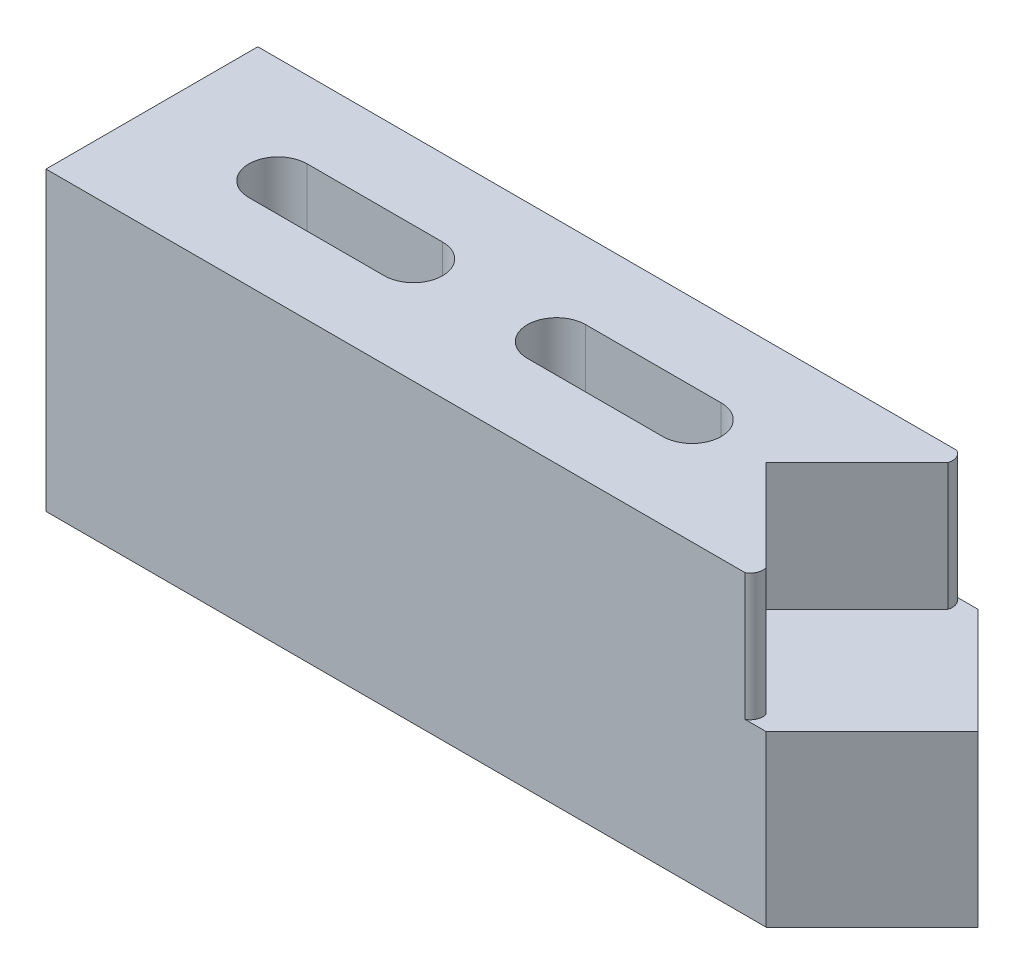
ISO-10303-21;
HEADER;
FILE_DESCRIPTION(('STEP AP214'),'2;1');
FILE_NAME('part.step','',(''),(''),'','','');
FILE_SCHEMA(('AUTOMOTIVE_DESIGN { 1 0 10303 214 1 1 1 1 }'));
ENDSEC;
DATA;
#1=APPLICATION_CONTEXT('core data for automotive mechanical design processes');
#2=APPLICATION_PROTOCOL_DEFINITION('international standard','automotive_design',2000,#1);
#3=PRODUCT_CONTEXT('',#1,'mechanical');
#4=PRODUCT('Part','Part','',(#3));
#5=PRODUCT_RELATED_PRODUCT_CATEGORY('part','',(#4));
#6=PRODUCT_DEFINITION_FORMATION('','',#4);
#7=PRODUCT_DEFINITION_CONTEXT('part definition',#1,'design');
#8=PRODUCT_DEFINITION('design','',#6,#7);
#9=PRODUCT_DEFINITION_SHAPE('','',#8);
#10=(LENGTH_UNIT() NAMED_UNIT(*) SI_UNIT(.MILLI.,.METRE.));
#11=(NAMED_UNIT(*) PLANE_ANGLE_UNIT() SI_UNIT($,.RADIAN.));
#12=(NAMED_UNIT(*) SI_UNIT($,.STERADIAN.) SOLID_ANGLE_UNIT());
#13=UNCERTAINTY_MEASURE_WITH_UNIT(LENGTH_MEASURE(1.E-05),#10,'distance_accuracy_value','');
#14=(GEOMETRIC_REPRESENTATION_CONTEXT(3) GLOBAL_UNCERTAINTY_ASSIGNED_CONTEXT((#13)) GLOBAL_UNIT_ASSIGNED_CONTEXT((#10,
#11,#12)) REPRESENTATION_CONTEXT('',''));
#15=CARTESIAN_POINT('',(0.,0.,0.));
#16=DIRECTION('',(0.,0.,1.));
#17=DIRECTION('',(1.,0.,0.));
#18=AXIS2_PLACEMENT_3D('',#15,#16,#17);
#19=CARTESIAN_POINT('',(0.,0.,-12.7));
#20=DIRECTION('',(-1.,0.,0.));
#21=DIRECTION('',(0.,0.,1.));
#22=AXIS2_PLACEMENT_3D('',#19,#20,#21);
#23=PLANE('',#22);
#24=DIRECTION('',(0.,-1.,0.));
#25=VECTOR('',#24,1.);
#26=CARTESIAN_POINT('',(0.,0.,0.));
#27=LINE('',#26,#25);
#28=CARTESIAN_POINT('',(0.,17.78,0.));
#29=VERTEX_POINT('',#28);
#30=CARTESIAN_POINT('',(0.,0.,0.));
#31=VERTEX_POINT('',#30);
#32=EDGE_CURVE('E191',#29,#31,#27,.T.);
#33=ORIENTED_EDGE('',*,*,#32,.F.);
#34=DIRECTION('',(0.,0.,1.));
#35=VECTOR('',#34,1.);
#36=CARTESIAN_POINT('',(0.,17.78,-12.7));
#37=LINE('',#36,#35);
#38=CARTESIAN_POINT('',(0.,17.78,-12.7));
#39=VERTEX_POINT('',#38);
#40=EDGE_CURVE('E11',#39,#29,#37,.T.);
#41=ORIENTED_EDGE('',*,*,#40,.F.);
#42=DIRECTION('',(0.,-1.,0.));
#43=VECTOR('',#42,1.);
#44=CARTESIAN_POINT('',(0.,0.,-12.7));
#45=LINE('',#44,#43);
#46=CARTESIAN_POINT('',(0.,0.,-12.7));
#47=VERTEX_POINT('',#46);
#48=EDGE_CURVE('E192',#39,#47,#45,.T.);
#49=ORIENTED_EDGE('',*,*,#48,.T.);
#50=DIRECTION('',(0.,0.,1.));
#51=VECTOR('',#50,1.);
#52=CARTESIAN_POINT('',(0.,0.,-12.7));
#53=LINE('',#52,#51);
#54=EDGE_CURVE('E38',#47,#31,#53,.T.);
#55=ORIENTED_EDGE('',*,*,#54,.T.);
#56=EDGE_LOOP('',(#33,#41,#49,#55));
#57=FACE_BOUND('',#56,.T.);
#58=ADVANCED_FACE('F35',(#57),#23,.T.);
#59=CARTESIAN_POINT('',(0.,17.78,-12.7));
#60=DIRECTION('',(0.,1.,0.));
#61=DIRECTION('',(0.,0.,1.));
#62=AXIS2_PLACEMENT_3D('',#59,#60,#61);
#63=PLANE('',#62);
#64=CARTESIAN_POINT('',(41.5537712268932,17.78,-12.0263939866578));
#65=DIRECTION('',(0.,-1.,0.));
#66=DIRECTION('',(0.,0.,-1.));
#67=AXIS2_PLACEMENT_3D('',#64,#65,#66);
#68=CIRCLE('',#67,0.762);
#69=CARTESIAN_POINT('',(41.91,17.78,-12.7));
#70=VERTEX_POINT('',#69);
#71=CARTESIAN_POINT('',(42.2819743878931,17.78,-11.8019743878931));
#72=VERTEX_POINT('',#71);
#73=EDGE_CURVE('E157',#70,#72,#68,.T.);
#74=ORIENTED_EDGE('',*,*,#73,.F.);
#75=DIRECTION('',(-1.,0.,0.));
#76=VECTOR('',#75,1.);
#77=CARTESIAN_POINT('',(0.,17.78,-12.7));
#78=LINE('',#77,#76);
#79=EDGE_CURVE('E202',#70,#39,#78,.T.);
#80=ORIENTED_EDGE('',*,*,#79,.T.);
#81=ORIENTED_EDGE('',*,*,#40,.T.);
#82=DIRECTION('',(-1.,0.,0.));
#83=VECTOR('',#82,1.);
#84=CARTESIAN_POINT('',(0.,17.78,0.));
#85=LINE('',#84,#83);
#86=CARTESIAN_POINT('',(41.91,17.78,0.));
#87=VERTEX_POINT('',#86);
#88=EDGE_CURVE('E196',#87,#29,#85,.T.);
#89=ORIENTED_EDGE('',*,*,#88,.F.);
#90=CARTESIAN_POINT('',(41.5537712268932,17.78,-0.673606013342209));
#91=DIRECTION('',(0.,-1.,0.));
#92=DIRECTION('',(0.,0.,1.));
#93=AXIS2_PLACEMENT_3D('',#90,#91,#92);
#94=CIRCLE('',#93,0.762);
#95=CARTESIAN_POINT('',(42.2819743878931,17.78,-0.898025612106916));
#96=VERTEX_POINT('',#95);
#97=EDGE_CURVE('E321',#96,#87,#94,.T.);
#98=ORIENTED_EDGE('',*,*,#97,.F.);
#99=DIRECTION('',(0.707106781186549,0.,0.707106781186546));
#100=VECTOR('',#99,1.);
#101=CARTESIAN_POINT('',(36.83,17.78,-6.35));
#102=LINE('',#101,#100);
#103=CARTESIAN_POINT('',(36.83,17.78,-6.35));
#104=VERTEX_POINT('',#103);
#105=EDGE_CURVE('E179',#104,#96,#102,.T.);
#106=ORIENTED_EDGE('',*,*,#105,.F.);
#107=DIRECTION('',(-0.707106781186549,0.,0.707106781186546));
#108=VECTOR('',#107,1.);
#109=CARTESIAN_POINT('',(43.18,17.78,-12.7));
#110=LINE('',#109,#108);
#111=EDGE_CURVE('E170',#72,#104,#110,.T.);
#112=ORIENTED_EDGE('',*,*,#111,.F.);
#113=EDGE_LOOP('',(#74,#80,#81,#89,#98,#106,#112));
#114=FACE_BOUND('',#113,.T.);
#115=CARTESIAN_POINT('',(32.381000008,17.78,-6.35));
#116=DIRECTION('',(0.,1.,0.));
#117=DIRECTION('',(0.,0.,1.));
#118=AXIS2_PLACEMENT_3D('',#115,#116,#117);
#119=CIRCLE('',#118,1.750000056);
#120=CARTESIAN_POINT('',(32.381000008,17.78,-4.599999944));
#121=VERTEX_POINT('',#120);
#122=CARTESIAN_POINT('',(32.381000008,17.78,-8.100000056));
#123=VERTEX_POINT('',#122);
#124=EDGE_CURVE('E57',#121,#123,#119,.T.);
#125=ORIENTED_EDGE('',*,*,#124,.F.);
#126=DIRECTION('',(1.,0.,0.));
#127=VECTOR('',#126,1.);
#128=CARTESIAN_POINT('',(32.381000008,17.78,-4.599999944));
#129=LINE('',#128,#127);
#130=CARTESIAN_POINT('',(24.260999992,17.78,-4.599999944));
#131=VERTEX_POINT('',#130);
#132=EDGE_CURVE('E257',#131,#121,#129,.T.);
#133=ORIENTED_EDGE('',*,*,#132,.F.);
#134=CARTESIAN_POINT('',(24.260999992,17.78,-6.35));
#135=DIRECTION('',(0.,1.,0.));
#136=DIRECTION('',(0.,0.,1.));
#137=AXIS2_PLACEMENT_3D('',#134,#135,#136);
#138=CIRCLE('',#137,1.750000056);
#139=CARTESIAN_POINT('',(24.260999992,17.78,-8.100000056));
#140=VERTEX_POINT('',#139);
#141=EDGE_CURVE('E272',#140,#131,#138,.T.);
#142=ORIENTED_EDGE('',*,*,#141,.F.);
#143=DIRECTION('',(-1.,0.,0.));
#144=VECTOR('',#143,1.);
#145=CARTESIAN_POINT('',(32.381000008,17.78,-8.100000056));
#146=LINE('',#145,#144);
#147=EDGE_CURVE('E268',#123,#140,#146,.T.);
#148=ORIENTED_EDGE('',*,*,#147,.F.);
#149=EDGE_LOOP('',(#125,#133,#142,#148));
#150=FACE_BOUND('',#149,.T.);
#151=CARTESIAN_POINT('',(15.68099988,17.78,-6.35));
#152=DIRECTION('',(0.,1.,0.));
#153=DIRECTION('',(0.,0.,1.));
#154=AXIS2_PLACEMENT_3D('',#151,#152,#153);
#155=CIRCLE('',#154,1.750000056);
#156=CARTESIAN_POINT('',(15.68099988,17.78,-4.599999944));
#157=VERTEX_POINT('',#156);
#158=CARTESIAN_POINT('',(15.68099988,17.78,-8.100000056));
#159=VERTEX_POINT('',#158);
#160=EDGE_CURVE('E251',#157,#159,#155,.T.);
#161=ORIENTED_EDGE('',*,*,#160,.F.);
#162=DIRECTION('',(1.,0.,0.));
#163=VECTOR('',#162,1.);
#164=CARTESIAN_POINT('',(15.68099988,17.78,-4.599999944));
#165=LINE('',#164,#163);
#166=CARTESIAN_POINT('',(7.56099986399997,17.78,-4.599999944));
#167=VERTEX_POINT('',#166);
#168=EDGE_CURVE('E285',#167,#157,#165,.T.);
#169=ORIENTED_EDGE('',*,*,#168,.F.);
#170=CARTESIAN_POINT('',(7.56099986399997,17.78,-6.35));
#171=DIRECTION('',(0.,1.,0.));
#172=DIRECTION('',(0.,0.,1.));
#173=AXIS2_PLACEMENT_3D('',#170,#171,#172);
#174=CIRCLE('',#173,1.750000056);
#175=CARTESIAN_POINT('',(7.56099986399997,17.78,-8.100000056));
#176=VERTEX_POINT('',#175);
#177=EDGE_CURVE('E299',#176,#167,#174,.T.);
#178=ORIENTED_EDGE('',*,*,#177,.F.);
#179=DIRECTION('',(-1.,0.,0.));
#180=VECTOR('',#179,1.);
#181=CARTESIAN_POINT('',(15.68099988,17.78,-8.100000056));
#182=LINE('',#181,#180);
#183=EDGE_CURVE('E296',#159,#176,#182,.T.);
#184=ORIENTED_EDGE('',*,*,#183,.F.);
#185=EDGE_LOOP('',(#161,#169,#178,#184));
#186=FACE_BOUND('',#185,.T.);
#187=ADVANCED_FACE('F175',(#114,#150,#186),#63,.T.);
#188=CARTESIAN_POINT('',(0.,0.,-12.7));
#189=DIRECTION('',(0.,-1.,0.));
#190=DIRECTION('',(0.,0.,-1.));
#191=AXIS2_PLACEMENT_3D('',#188,#189,#190);
#192=PLANE('',#191);
#193=CARTESIAN_POINT('',(32.381000008,0.,-6.35));
#194=DIRECTION('',(0.,1.,0.));
#195=DIRECTION('',(0.,0.,1.));
#196=AXIS2_PLACEMENT_3D('',#193,#194,#195);
#197=CIRCLE('',#196,1.750000056);
#198=CARTESIAN_POINT('',(32.381000008,0.,-4.599999944));
#199=VERTEX_POINT('',#198);
#200=CARTESIAN_POINT('',(32.381000008,0.,-8.100000056));
#201=VERTEX_POINT('',#200);
#202=EDGE_CURVE('E253',#199,#201,#197,.T.);
#203=ORIENTED_EDGE('',*,*,#202,.T.);
#204=DIRECTION('',(-1.,0.,0.));
#205=VECTOR('',#204,1.);
#206=CARTESIAN_POINT('',(32.381000008,0.,-8.100000056));
#207=LINE('',#206,#205);
#208=CARTESIAN_POINT('',(24.260999992,0.,-8.100000056));
#209=VERTEX_POINT('',#208);
#210=EDGE_CURVE('E256',#201,#209,#207,.T.);
#211=ORIENTED_EDGE('',*,*,#210,.T.);
#212=CARTESIAN_POINT('',(24.260999992,0.,-6.35));
#213=DIRECTION('',(0.,1.,0.));
#214=DIRECTION('',(0.,0.,1.));
#215=AXIS2_PLACEMENT_3D('',#212,#213,#214);
#216=CIRCLE('',#215,1.750000056);
#217=CARTESIAN_POINT('',(24.260999992,0.,-4.599999944));
#218=VERTEX_POINT('',#217);
#219=EDGE_CURVE('E260',#209,#218,#216,.T.);
#220=ORIENTED_EDGE('',*,*,#219,.T.);
#221=DIRECTION('',(1.,0.,0.));
#222=VECTOR('',#221,1.);
#223=CARTESIAN_POINT('',(32.381000008,0.,-4.599999944));
#224=LINE('',#223,#222);
#225=EDGE_CURVE('E263',#218,#199,#224,.T.);
#226=ORIENTED_EDGE('',*,*,#225,.T.);
#227=EDGE_LOOP('',(#203,#211,#220,#226));
#228=FACE_BOUND('',#227,.T.);
#229=CARTESIAN_POINT('',(15.68099988,0.,-6.35));
#230=DIRECTION('',(0.,1.,0.));
#231=DIRECTION('',(0.,0.,1.));
#232=AXIS2_PLACEMENT_3D('',#229,#230,#231);
#233=CIRCLE('',#232,1.750000056);
#234=CARTESIAN_POINT('',(15.68099988,0.,-4.599999944));
#235=VERTEX_POINT('',#234);
#236=CARTESIAN_POINT('',(15.68099988,0.,-8.100000056));
#237=VERTEX_POINT('',#236);
#238=EDGE_CURVE('E281',#235,#237,#233,.T.);
#239=ORIENTED_EDGE('',*,*,#238,.T.);
#240=DIRECTION('',(-1.,0.,0.));
#241=VECTOR('',#240,1.);
#242=CARTESIAN_POINT('',(15.68099988,0.,-8.100000056));
#243=LINE('',#242,#241);
#244=CARTESIAN_POINT('',(7.56099986399997,0.,-8.100000056));
#245=VERTEX_POINT('',#244);
#246=EDGE_CURVE('E284',#237,#245,#243,.T.);
#247=ORIENTED_EDGE('',*,*,#246,.T.);
#248=CARTESIAN_POINT('',(7.56099986399997,0.,-6.35));
#249=DIRECTION('',(0.,1.,0.));
#250=DIRECTION('',(0.,0.,1.));
#251=AXIS2_PLACEMENT_3D('',#248,#249,#250);
#252=CIRCLE('',#251,1.750000056);
#253=CARTESIAN_POINT('',(7.56099986399997,0.,-4.599999944));
#254=VERTEX_POINT('',#253);
#255=EDGE_CURVE('E288',#245,#254,#252,.T.);
#256=ORIENTED_EDGE('',*,*,#255,.T.);
#257=DIRECTION('',(1.,0.,0.));
#258=VECTOR('',#257,1.);
#259=CARTESIAN_POINT('',(15.68099988,0.,-4.599999944));
#260=LINE('',#259,#258);
#261=EDGE_CURVE('E291',#254,#235,#260,.T.);
#262=ORIENTED_EDGE('',*,*,#261,.T.);
#263=EDGE_LOOP('',(#239,#247,#256,#262));
#264=FACE_BOUND('',#263,.T.);
#265=DIRECTION('',(1.,0.,0.));
#266=VECTOR('',#265,1.);
#267=CARTESIAN_POINT('',(0.,0.,0.));
#268=LINE('',#267,#266);
#269=CARTESIAN_POINT('',(43.18,0.,0.));
#270=VERTEX_POINT('',#269);
#271=EDGE_CURVE('E206',#31,#270,#268,.T.);
#272=ORIENTED_EDGE('',*,*,#271,.F.);
#273=ORIENTED_EDGE('',*,*,#54,.F.);
#274=DIRECTION('',(1.,0.,0.));
#275=VECTOR('',#274,1.);
#276=CARTESIAN_POINT('',(0.,0.,-12.7));
#277=LINE('',#276,#275);
#278=CARTESIAN_POINT('',(43.18,0.,-12.7));
#279=VERTEX_POINT('',#278);
#280=EDGE_CURVE('E195',#47,#279,#277,.T.);
#281=ORIENTED_EDGE('',*,*,#280,.T.);
#282=DIRECTION('',(-0.707106781186549,0.,-0.707106781186546));
#283=VECTOR('',#282,1.);
#284=CARTESIAN_POINT('',(43.18,0.,-12.7));
#285=LINE('',#284,#283);
#286=CARTESIAN_POINT('',(49.53,0.,-6.35));
#287=VERTEX_POINT('',#286);
#288=EDGE_CURVE('E249',#287,#279,#285,.T.);
#289=ORIENTED_EDGE('',*,*,#288,.F.);
#290=DIRECTION('',(0.707106781186549,0.,-0.707106781186546));
#291=VECTOR('',#290,1.);
#292=CARTESIAN_POINT('',(49.53,0.,-6.35000000000001));
#293=LINE('',#292,#291);
#294=EDGE_CURVE('E228',#270,#287,#293,.T.);
#295=ORIENTED_EDGE('',*,*,#294,.F.);
#296=EDGE_LOOP('',(#272,#273,#281,#289,#295));
#297=FACE_BOUND('',#296,.T.);
#298=ADVANCED_FACE('F226',(#228,#264,#297),#192,.T.);
#299=CARTESIAN_POINT('',(0.,0.,-12.7));
#300=DIRECTION('',(0.,0.,-1.));
#301=DIRECTION('',(-1.,0.,0.));
#302=AXIS2_PLACEMENT_3D('',#299,#300,#301);
#303=PLANE('',#302);
#304=DIRECTION('',(0.,1.,0.));
#305=VECTOR('',#304,1.);
#306=CARTESIAN_POINT('',(41.91,8.60457401333269,-12.7));
#307=LINE('',#306,#305);
#308=CARTESIAN_POINT('',(41.91,10.16,-12.7));
#309=VERTEX_POINT('',#308);
#310=EDGE_CURVE('E160',#309,#70,#307,.T.);
#311=ORIENTED_EDGE('',*,*,#310,.F.);
#312=DIRECTION('',(1.,0.,0.));
#313=VECTOR('',#312,1.);
#314=CARTESIAN_POINT('',(41.91,10.16,-12.7));
#315=LINE('',#314,#313);
#316=CARTESIAN_POINT('',(43.18,10.16,-12.7));
#317=VERTEX_POINT('',#316);
#318=EDGE_CURVE('E244',#309,#317,#315,.T.);
#319=ORIENTED_EDGE('',*,*,#318,.T.);
#320=DIRECTION('',(0.,1.,0.));
#321=VECTOR('',#320,1.);
#322=CARTESIAN_POINT('',(43.18,0.,-12.7));
#323=LINE('',#322,#321);
#324=EDGE_CURVE('E199',#279,#317,#323,.T.);
#325=ORIENTED_EDGE('',*,*,#324,.F.);
#326=ORIENTED_EDGE('',*,*,#280,.F.);
#327=ORIENTED_EDGE('',*,*,#48,.F.);
#328=ORIENTED_EDGE('',*,*,#79,.F.);
#329=EDGE_LOOP('',(#311,#319,#325,#326,#327,#328));
#330=FACE_BOUND('',#329,.T.);
#331=ADVANCED_FACE('F329',(#330),#303,.T.);
#332=CARTESIAN_POINT('',(0.,0.,0.));
#333=DIRECTION('',(0.,0.,-1.));
#334=DIRECTION('',(-1.,0.,0.));
#335=AXIS2_PLACEMENT_3D('',#332,#333,#334);
#336=PLANE('',#335);
#337=DIRECTION('',(-1.,0.,0.));
#338=VECTOR('',#337,1.);
#339=CARTESIAN_POINT('',(41.91,10.16,0.));
#340=LINE('',#339,#338);
#341=CARTESIAN_POINT('',(43.18,10.16,0.));
#342=VERTEX_POINT('',#341);
#343=CARTESIAN_POINT('',(41.91,10.16,0.));
#344=VERTEX_POINT('',#343);
#345=EDGE_CURVE('E164',#342,#344,#340,.T.);
#346=ORIENTED_EDGE('',*,*,#345,.T.);
#347=DIRECTION('',(0.,1.,0.));
#348=VECTOR('',#347,1.);
#349=CARTESIAN_POINT('',(41.91,8.60457401333269,0.));
#350=LINE('',#349,#348);
#351=EDGE_CURVE('E219',#344,#87,#350,.T.);
#352=ORIENTED_EDGE('',*,*,#351,.T.);
#353=ORIENTED_EDGE('',*,*,#88,.T.);
#354=ORIENTED_EDGE('',*,*,#32,.T.);
#355=ORIENTED_EDGE('',*,*,#271,.T.);
#356=DIRECTION('',(0.,1.,0.));
#357=VECTOR('',#356,1.);
#358=CARTESIAN_POINT('',(43.18,0.,0.));
#359=LINE('',#358,#357);
#360=EDGE_CURVE('E209',#270,#342,#359,.T.);
#361=ORIENTED_EDGE('',*,*,#360,.T.);
#362=EDGE_LOOP('',(#346,#352,#353,#354,#355,#361));
#363=FACE_BOUND('',#362,.T.);
#364=ADVANCED_FACE('F216',(#363),#336,.F.);
#365=CARTESIAN_POINT('',(36.83,10.16,-6.35));
#366=DIRECTION('',(-0.707106781186546,0.,0.707106781186549));
#367=DIRECTION('',(0.707106781186549,0.,0.707106781186546));
#368=AXIS2_PLACEMENT_3D('',#365,#366,#367);
#369=PLANE('',#368);
#370=ORIENTED_EDGE('',*,*,#105,.T.);
#371=DIRECTION('',(0.,1.,0.));
#372=VECTOR('',#371,1.);
#373=CARTESIAN_POINT('',(42.2819743878931,8.60457401333269,-0.898025612106916));
#374=LINE('',#373,#372);
#375=CARTESIAN_POINT('',(42.2819743878931,10.16,-0.898025612106916));
#376=VERTEX_POINT('',#375);
#377=EDGE_CURVE('E317',#376,#96,#374,.T.);
#378=ORIENTED_EDGE('',*,*,#377,.F.);
#379=DIRECTION('',(0.707106781186549,0.,0.707106781186546));
#380=VECTOR('',#379,1.);
#381=CARTESIAN_POINT('',(36.83,10.16,-6.35));
#382=LINE('',#381,#380);
#383=CARTESIAN_POINT('',(36.83,10.16,-6.35));
#384=VERTEX_POINT('',#383);
#385=EDGE_CURVE('E186',#384,#376,#382,.T.);
#386=ORIENTED_EDGE('',*,*,#385,.F.);
#387=DIRECTION('',(0.,1.,0.));
#388=VECTOR('',#387,1.);
#389=CARTESIAN_POINT('',(36.83,10.16,-6.35));
#390=LINE('',#389,#388);
#391=EDGE_CURVE('E189',#384,#104,#390,.T.);
#392=ORIENTED_EDGE('',*,*,#391,.T.);
#393=EDGE_LOOP('',(#370,#378,#386,#392));
#394=FACE_BOUND('',#393,.T.);
#395=ADVANCED_FACE('F316',(#394),#369,.F.);
#396=CARTESIAN_POINT('',(43.18,10.16,-12.7));
#397=DIRECTION('',(-0.707106781186546,0.,-0.707106781186549));
#398=DIRECTION('',(-0.707106781186549,0.,0.707106781186546));
#399=AXIS2_PLACEMENT_3D('',#396,#397,#398);
#400=PLANE('',#399);
#401=DIRECTION('',(-0.707106781186549,0.,0.707106781186546));
#402=VECTOR('',#401,1.);
#403=CARTESIAN_POINT('',(43.18,10.16,-12.7));
#404=LINE('',#403,#402);
#405=CARTESIAN_POINT('',(42.2819743878931,10.16,-11.8019743878931));
#406=VERTEX_POINT('',#405);
#407=EDGE_CURVE('E172',#406,#384,#404,.T.);
#408=ORIENTED_EDGE('',*,*,#407,.F.);
#409=DIRECTION('',(0.,1.,0.));
#410=VECTOR('',#409,1.);
#411=CARTESIAN_POINT('',(42.2819743878931,8.60457401333269,-11.8019743878931));
#412=LINE('',#411,#410);
#413=EDGE_CURVE('E49',#406,#72,#412,.T.);
#414=ORIENTED_EDGE('',*,*,#413,.T.);
#415=ORIENTED_EDGE('',*,*,#111,.T.);
#416=ORIENTED_EDGE('',*,*,#391,.F.);
#417=EDGE_LOOP('',(#408,#414,#415,#416));
#418=FACE_BOUND('',#417,.T.);
#419=ADVANCED_FACE('F168',(#418),#400,.F.);
#420=CARTESIAN_POINT('',(0.,10.16,0.));
#421=DIRECTION('',(0.,1.,0.));
#422=DIRECTION('',(-1.,0.,0.));
#423=AXIS2_PLACEMENT_3D('',#420,#421,#422);
#424=PLANE('',#423);
#425=ORIENTED_EDGE('',*,*,#385,.T.);
#426=CARTESIAN_POINT('',(41.5537712268932,10.16,-0.673606013342209));
#427=DIRECTION('',(0.,1.,0.));
#428=DIRECTION('',(-1.,0.,0.));
#429=AXIS2_PLACEMENT_3D('',#426,#427,#428);
#430=CIRCLE('',#429,0.762);
#431=EDGE_CURVE('E313',#344,#376,#430,.T.);
#432=ORIENTED_EDGE('',*,*,#431,.F.);
#433=ORIENTED_EDGE('',*,*,#345,.F.);
#434=DIRECTION('',(0.707106781186549,0.,-0.707106781186546));
#435=VECTOR('',#434,1.);
#436=CARTESIAN_POINT('',(49.53,10.16,-6.35));
#437=LINE('',#436,#435);
#438=CARTESIAN_POINT('',(49.53,10.16,-6.35));
#439=VERTEX_POINT('',#438);
#440=EDGE_CURVE('E234',#342,#439,#437,.T.);
#441=ORIENTED_EDGE('',*,*,#440,.T.);
#442=DIRECTION('',(-0.707106781186549,0.,-0.707106781186546));
#443=VECTOR('',#442,1.);
#444=CARTESIAN_POINT('',(43.18,10.16,-12.7));
#445=LINE('',#444,#443);
#446=EDGE_CURVE('E240',#439,#317,#445,.T.);
#447=ORIENTED_EDGE('',*,*,#446,.T.);
#448=ORIENTED_EDGE('',*,*,#318,.F.);
#449=CARTESIAN_POINT('',(41.5537712268932,10.16,-12.0263939866578));
#450=DIRECTION('',(0.,1.,0.));
#451=DIRECTION('',(-1.,0.,0.));
#452=AXIS2_PLACEMENT_3D('',#449,#450,#451);
#453=CIRCLE('',#452,0.762);
#454=EDGE_CURVE('E241',#406,#309,#453,.T.);
#455=ORIENTED_EDGE('',*,*,#454,.F.);
#456=ORIENTED_EDGE('',*,*,#407,.T.);
#457=EDGE_LOOP('',(#425,#432,#433,#441,#447,#448,#455,#456));
#458=FACE_BOUND('',#457,.T.);
#459=ADVANCED_FACE('F312',(#458),#424,.T.);
#460=CARTESIAN_POINT('',(15.68099988,0.,-6.35));
#461=DIRECTION('',(0.,1.,0.));
#462=DIRECTION('',(0.,0.,1.));
#463=AXIS2_PLACEMENT_3D('',#460,#461,#462);
#464=CYLINDRICAL_SURFACE('',#463,1.750000056);
#465=ORIENTED_EDGE('',*,*,#160,.T.);
#466=DIRECTION('',(0.,1.,0.));
#467=VECTOR('',#466,1.);
#468=CARTESIAN_POINT('',(15.68099988,0.,-8.100000056));
#469=LINE('',#468,#467);
#470=EDGE_CURVE('E294',#237,#159,#469,.T.);
#471=ORIENTED_EDGE('',*,*,#470,.F.);
#472=ORIENTED_EDGE('',*,*,#238,.F.);
#473=DIRECTION('',(0.,1.,0.));
#474=VECTOR('',#473,1.);
#475=CARTESIAN_POINT('',(15.68099988,0.,-4.599999944));
#476=LINE('',#475,#474);
#477=EDGE_CURVE('E269',#235,#157,#476,.T.);
#478=ORIENTED_EDGE('',*,*,#477,.T.);
#479=EDGE_LOOP('',(#465,#471,#472,#478));
#480=FACE_BOUND('',#479,.T.);
#481=ADVANCED_FACE('F364',(#480),#464,.F.);
#482=CARTESIAN_POINT('',(15.68099988,0.,-4.599999944));
#483=DIRECTION('',(0.,0.,1.));
#484=DIRECTION('',(1.,0.,0.));
#485=AXIS2_PLACEMENT_3D('',#482,#483,#484);
#486=PLANE('',#485);
#487=ORIENTED_EDGE('',*,*,#168,.T.);
#488=ORIENTED_EDGE('',*,*,#477,.F.);
#489=ORIENTED_EDGE('',*,*,#261,.F.);
#490=DIRECTION('',(0.,1.,0.));
#491=VECTOR('',#490,1.);
#492=CARTESIAN_POINT('',(7.56099986399997,0.,-4.599999944));
#493=LINE('',#492,#491);
#494=EDGE_CURVE('E305',#254,#167,#493,.T.);
#495=ORIENTED_EDGE('',*,*,#494,.T.);
#496=EDGE_LOOP('',(#487,#488,#489,#495));
#497=FACE_BOUND('',#496,.T.);
#498=ADVANCED_FACE('F367',(#497),#486,.F.);
#499=CARTESIAN_POINT('',(7.56099986399997,0.,-6.35));
#500=DIRECTION('',(0.,1.,0.));
#501=DIRECTION('',(0.,0.,1.));
#502=AXIS2_PLACEMENT_3D('',#499,#500,#501);
#503=CYLINDRICAL_SURFACE('',#502,1.750000056);
#504=ORIENTED_EDGE('',*,*,#177,.T.);
#505=ORIENTED_EDGE('',*,*,#494,.F.);
#506=ORIENTED_EDGE('',*,*,#255,.F.);
#507=DIRECTION('',(0.,1.,0.));
#508=VECTOR('',#507,1.);
#509=CARTESIAN_POINT('',(7.56099986399997,0.,-8.100000056));
#510=LINE('',#509,#508);
#511=EDGE_CURVE('E307',#245,#176,#510,.T.);
#512=ORIENTED_EDGE('',*,*,#511,.T.);
#513=EDGE_LOOP('',(#504,#505,#506,#512));
#514=FACE_BOUND('',#513,.T.);
#515=ADVANCED_FACE('F373',(#514),#503,.F.);
#516=CARTESIAN_POINT('',(15.68099988,0.,-8.100000056));
#517=DIRECTION('',(0.,0.,-1.));
#518=DIRECTION('',(-1.,0.,0.));
#519=AXIS2_PLACEMENT_3D('',#516,#517,#518);
#520=PLANE('',#519);
#521=ORIENTED_EDGE('',*,*,#183,.T.);
#522=ORIENTED_EDGE('',*,*,#511,.F.);
#523=ORIENTED_EDGE('',*,*,#246,.F.);
#524=ORIENTED_EDGE('',*,*,#470,.T.);
#525=EDGE_LOOP('',(#521,#522,#523,#524));
#526=FACE_BOUND('',#525,.T.);
#527=ADVANCED_FACE('F369',(#526),#520,.F.);
#528=CARTESIAN_POINT('',(32.381000008,0.,-6.35));
#529=DIRECTION('',(0.,1.,0.));
#530=DIRECTION('',(0.,0.,1.));
#531=AXIS2_PLACEMENT_3D('',#528,#529,#530);
#532=CYLINDRICAL_SURFACE('',#531,1.750000056);
#533=ORIENTED_EDGE('',*,*,#124,.T.);
#534=DIRECTION('',(0.,1.,0.));
#535=VECTOR('',#534,1.);
#536=CARTESIAN_POINT('',(32.381000008,0.,-8.100000056));
#537=LINE('',#536,#535);
#538=EDGE_CURVE('E266',#201,#123,#537,.T.);
#539=ORIENTED_EDGE('',*,*,#538,.F.);
#540=ORIENTED_EDGE('',*,*,#202,.F.);
#541=DIRECTION('',(0.,1.,0.));
#542=VECTOR('',#541,1.);
#543=CARTESIAN_POINT('',(32.381000008,0.,-4.599999944));
#544=LINE('',#543,#542);
#545=EDGE_CURVE('E180',#199,#121,#544,.T.);
#546=ORIENTED_EDGE('',*,*,#545,.T.);
#547=EDGE_LOOP('',(#533,#539,#540,#546));
#548=FACE_BOUND('',#547,.T.);
#549=ADVANCED_FACE('F372',(#548),#532,.F.);
#550=CARTESIAN_POINT('',(32.381000008,0.,-4.599999944));
#551=DIRECTION('',(0.,0.,1.));
#552=DIRECTION('',(1.,0.,0.));
#553=AXIS2_PLACEMENT_3D('',#550,#551,#552);
#554=PLANE('',#553);
#555=ORIENTED_EDGE('',*,*,#132,.T.);
#556=ORIENTED_EDGE('',*,*,#545,.F.);
#557=ORIENTED_EDGE('',*,*,#225,.F.);
#558=DIRECTION('',(0.,1.,0.));
#559=VECTOR('',#558,1.);
#560=CARTESIAN_POINT('',(24.260999992,0.,-4.599999944));
#561=LINE('',#560,#559);
#562=EDGE_CURVE('E183',#218,#131,#561,.T.);
#563=ORIENTED_EDGE('',*,*,#562,.T.);
#564=EDGE_LOOP('',(#555,#556,#557,#563));
#565=FACE_BOUND('',#564,.T.);
#566=ADVANCED_FACE('F383',(#565),#554,.F.);
#567=CARTESIAN_POINT('',(24.260999992,0.,-6.35));
#568=DIRECTION('',(0.,1.,0.));
#569=DIRECTION('',(0.,0.,1.));
#570=AXIS2_PLACEMENT_3D('',#567,#568,#569);
#571=CYLINDRICAL_SURFACE('',#570,1.750000056);
#572=ORIENTED_EDGE('',*,*,#141,.T.);
#573=ORIENTED_EDGE('',*,*,#562,.F.);
#574=ORIENTED_EDGE('',*,*,#219,.F.);
#575=DIRECTION('',(0.,1.,0.));
#576=VECTOR('',#575,1.);
#577=CARTESIAN_POINT('',(24.260999992,0.,-8.100000056));
#578=LINE('',#577,#576);
#579=EDGE_CURVE('E278',#209,#140,#578,.T.);
#580=ORIENTED_EDGE('',*,*,#579,.T.);
#581=EDGE_LOOP('',(#572,#573,#574,#580));
#582=FACE_BOUND('',#581,.T.);
#583=ADVANCED_FACE('F386',(#582),#571,.F.);
#584=CARTESIAN_POINT('',(32.381000008,0.,-8.100000056));
#585=DIRECTION('',(0.,0.,-1.));
#586=DIRECTION('',(-1.,0.,0.));
#587=AXIS2_PLACEMENT_3D('',#584,#585,#586);
#588=PLANE('',#587);
#589=ORIENTED_EDGE('',*,*,#147,.T.);
#590=ORIENTED_EDGE('',*,*,#579,.F.);
#591=ORIENTED_EDGE('',*,*,#210,.F.);
#592=ORIENTED_EDGE('',*,*,#538,.T.);
#593=EDGE_LOOP('',(#589,#590,#591,#592));
#594=FACE_BOUND('',#593,.T.);
#595=ADVANCED_FACE('F341',(#594),#588,.F.);
#596=CARTESIAN_POINT('',(49.53,-14.1990316571237,-6.35));
#597=DIRECTION('',(0.707106781186546,0.,0.707106781186549));
#598=DIRECTION('',(0.707106781186549,0.,-0.707106781186546));
#599=AXIS2_PLACEMENT_3D('',#596,#597,#598);
#600=PLANE('',#599);
#601=ORIENTED_EDGE('',*,*,#360,.F.);
#602=ORIENTED_EDGE('',*,*,#294,.T.);
#603=DIRECTION('',(0.,1.,0.));
#604=VECTOR('',#603,1.);
#605=CARTESIAN_POINT('',(49.53,-14.1990316571237,-6.35));
#606=LINE('',#605,#604);
#607=EDGE_CURVE('E236',#287,#439,#606,.T.);
#608=ORIENTED_EDGE('',*,*,#607,.T.);
#609=ORIENTED_EDGE('',*,*,#440,.F.);
#610=EDGE_LOOP('',(#601,#602,#608,#609));
#611=FACE_BOUND('',#610,.T.);
#612=ADVANCED_FACE('F232',(#611),#600,.T.);
#613=CARTESIAN_POINT('',(43.18,-14.1990316571237,-12.7));
#614=DIRECTION('',(0.707106781186546,0.,-0.707106781186549));
#615=DIRECTION('',(-0.707106781186549,0.,-0.707106781186546));
#616=AXIS2_PLACEMENT_3D('',#613,#614,#615);
#617=PLANE('',#616);
#618=ORIENTED_EDGE('',*,*,#607,.F.);
#619=ORIENTED_EDGE('',*,*,#288,.T.);
#620=ORIENTED_EDGE('',*,*,#324,.T.);
#621=ORIENTED_EDGE('',*,*,#446,.F.);
#622=EDGE_LOOP('',(#618,#619,#620,#621));
#623=FACE_BOUND('',#622,.T.);
#624=ADVANCED_FACE('F331',(#623),#617,.T.);
#625=CARTESIAN_POINT('',(41.5537712268932,8.60457401333269,-0.673606013342209));
#626=DIRECTION('',(0.,1.,0.));
#627=DIRECTION('',(0.,0.,1.));
#628=AXIS2_PLACEMENT_3D('',#625,#626,#627);
#629=CYLINDRICAL_SURFACE('',#628,0.762);
#630=ORIENTED_EDGE('',*,*,#431,.T.);
#631=ORIENTED_EDGE('',*,*,#377,.T.);
#632=ORIENTED_EDGE('',*,*,#97,.T.);
#633=ORIENTED_EDGE('',*,*,#351,.F.);
#634=EDGE_LOOP('',(#630,#631,#632,#633));
#635=FACE_BOUND('',#634,.T.);
#636=ADVANCED_FACE('F333',(#635),#629,.T.);
#637=CARTESIAN_POINT('',(41.5537712268932,8.60457401333269,-12.0263939866578));
#638=DIRECTION('',(0.,1.,0.));
#639=DIRECTION('',(0.,0.,1.));
#640=AXIS2_PLACEMENT_3D('',#637,#638,#639);
#641=CYLINDRICAL_SURFACE('',#640,0.762);
#642=ORIENTED_EDGE('',*,*,#454,.T.);
#643=ORIENTED_EDGE('',*,*,#310,.T.);
#644=ORIENTED_EDGE('',*,*,#73,.T.);
#645=ORIENTED_EDGE('',*,*,#413,.F.);
#646=EDGE_LOOP('',(#642,#643,#644,#645));
#647=FACE_BOUND('',#646,.T.);
#648=ADVANCED_FACE('F158',(#647),#641,.T.);
#649=CLOSED_SHELL('',(#58,#187,#298,#331,#364,#395,#419,#459,#481,#498,#515,#527,#549,#566,#583,
#595,#612,#624,#636,#648));
#650=MANIFOLD_SOLID_BREP('B2',#649);
#651=ADVANCED_BREP_SHAPE_REPRESENTATION('',(#18,#650),#14);
#652=SHAPE_DEFINITION_REPRESENTATION(#9,#651);
ENDSEC;
END-ISO-10303-21;
